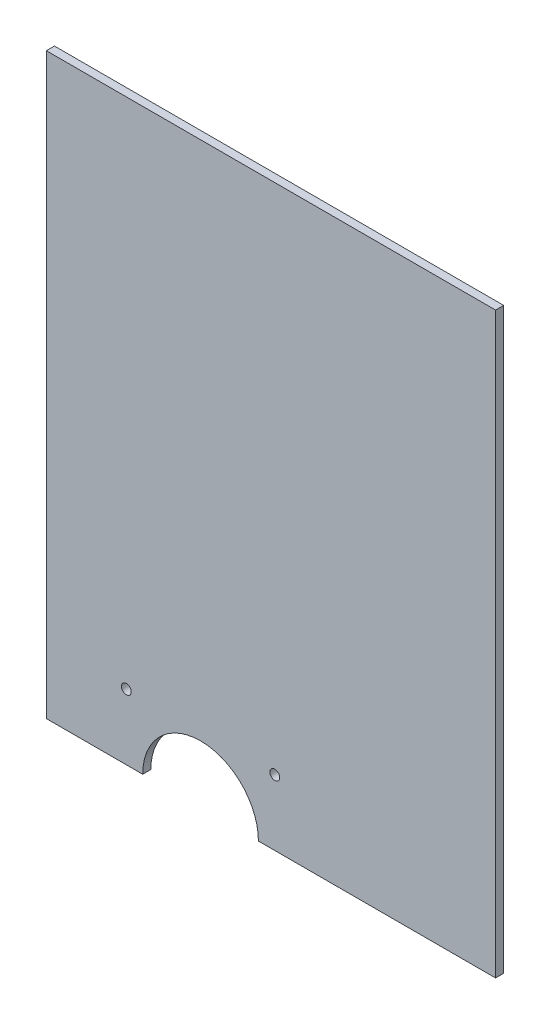
ISO-10303-21;
HEADER;
FILE_DESCRIPTION(('STEP AP214'),'2;1');
FILE_NAME('part.step','',(''),(''),'','','');
FILE_SCHEMA(('AUTOMOTIVE_DESIGN { 1 0 10303 214 1 1 1 1 }'));
ENDSEC;
DATA;
#1=APPLICATION_CONTEXT('core data for automotive mechanical design processes');
#2=APPLICATION_PROTOCOL_DEFINITION('international standard','automotive_design',2000,#1);
#3=PRODUCT_CONTEXT('',#1,'mechanical');
#4=PRODUCT('Part','Part','',(#3));
#5=PRODUCT_RELATED_PRODUCT_CATEGORY('part','',(#4));
#6=PRODUCT_DEFINITION_FORMATION('','',#4);
#7=PRODUCT_DEFINITION_CONTEXT('part definition',#1,'design');
#8=PRODUCT_DEFINITION('design','',#6,#7);
#9=PRODUCT_DEFINITION_SHAPE('','',#8);
#10=(LENGTH_UNIT() NAMED_UNIT(*) SI_UNIT(.MILLI.,.METRE.));
#11=(NAMED_UNIT(*) PLANE_ANGLE_UNIT() SI_UNIT($,.RADIAN.));
#12=(NAMED_UNIT(*) SI_UNIT($,.STERADIAN.) SOLID_ANGLE_UNIT());
#13=UNCERTAINTY_MEASURE_WITH_UNIT(LENGTH_MEASURE(1.E-05),#10,'distance_accuracy_value','');
#14=(GEOMETRIC_REPRESENTATION_CONTEXT(3) GLOBAL_UNCERTAINTY_ASSIGNED_CONTEXT((#13)) GLOBAL_UNIT_ASSIGNED_CONTEXT((#10,
#11,#12)) REPRESENTATION_CONTEXT('',''));
#15=CARTESIAN_POINT('',(0.,0.,0.));
#16=DIRECTION('',(0.,0.,1.));
#17=DIRECTION('',(1.,0.,0.));
#18=AXIS2_PLACEMENT_3D('',#15,#16,#17);
#19=CARTESIAN_POINT('',(-119.563037439145,-231.267653758542,4.2));
#20=DIRECTION('',(0.,1.,0.));
#21=DIRECTION('',(0.,0.,1.));
#22=AXIS2_PLACEMENT_3D('',#19,#20,#21);
#23=PLANE('',#22);
#24=DIRECTION('',(1.,0.,0.));
#25=VECTOR('',#24,1.);
#26=CARTESIAN_POINT('',(-119.563037439145,-231.267653758542,0.));
#27=LINE('',#26,#25);
#28=CARTESIAN_POINT('',(-119.563037439145,-231.267653758542,0.));
#29=VERTEX_POINT('',#28);
#30=CARTESIAN_POINT('',(-69.5630374391453,-231.267653758542,0.));
#31=VERTEX_POINT('',#30);
#32=EDGE_CURVE('E124',#29,#31,#27,.T.);
#33=ORIENTED_EDGE('',*,*,#32,.T.);
#34=DIRECTION('',(0.,0.,1.));
#35=VECTOR('',#34,1.);
#36=CARTESIAN_POINT('',(-69.5630374391453,-231.267653758542,0.));
#37=LINE('',#36,#35);
#38=CARTESIAN_POINT('',(-69.5630374391453,-231.267653758542,4.2));
#39=VERTEX_POINT('',#38);
#40=EDGE_CURVE('E55',#31,#39,#37,.T.);
#41=ORIENTED_EDGE('',*,*,#40,.T.);
#42=DIRECTION('',(1.,0.,0.));
#43=VECTOR('',#42,1.);
#44=CARTESIAN_POINT('',(-119.563037439145,-231.267653758542,4.2));
#45=LINE('',#44,#43);
#46=CARTESIAN_POINT('',(-119.563037439145,-231.267653758542,4.2));
#47=VERTEX_POINT('',#46);
#48=EDGE_CURVE('E91',#47,#39,#45,.T.);
#49=ORIENTED_EDGE('',*,*,#48,.F.);
#50=DIRECTION('',(0.,0.,-1.));
#51=VECTOR('',#50,1.);
#52=CARTESIAN_POINT('',(-119.563037439145,-231.267653758542,4.2));
#53=LINE('',#52,#51);
#54=EDGE_CURVE('E11',#47,#29,#53,.T.);
#55=ORIENTED_EDGE('',*,*,#54,.T.);
#56=EDGE_LOOP('',(#33,#41,#49,#55));
#57=FACE_BOUND('',#56,.T.);
#58=ADVANCED_FACE('F39',(#57),#23,.F.);
#59=CARTESIAN_POINT('',(-119.563037439145,68.7323462414579,4.2));
#60=DIRECTION('',(1.,0.,0.));
#61=DIRECTION('',(0.,1.,0.));
#62=AXIS2_PLACEMENT_3D('',#59,#60,#61);
#63=PLANE('',#62);
#64=DIRECTION('',(0.,-1.,0.));
#65=VECTOR('',#64,1.);
#66=CARTESIAN_POINT('',(-119.563037439145,68.7323462414579,0.));
#67=LINE('',#66,#65);
#68=CARTESIAN_POINT('',(-119.563037439145,68.7323462414579,0.));
#69=VERTEX_POINT('',#68);
#70=EDGE_CURVE('E125',#69,#29,#67,.T.);
#71=ORIENTED_EDGE('',*,*,#70,.T.);
#72=ORIENTED_EDGE('',*,*,#54,.F.);
#73=DIRECTION('',(0.,-1.,0.));
#74=VECTOR('',#73,1.);
#75=CARTESIAN_POINT('',(-119.563037439145,68.7323462414579,4.2));
#76=LINE('',#75,#74);
#77=CARTESIAN_POINT('',(-119.563037439145,68.7323462414579,4.2));
#78=VERTEX_POINT('',#77);
#79=EDGE_CURVE('E138',#78,#47,#76,.T.);
#80=ORIENTED_EDGE('',*,*,#79,.F.);
#81=DIRECTION('',(0.,0.,-1.));
#82=VECTOR('',#81,1.);
#83=CARTESIAN_POINT('',(-119.563037439145,68.7323462414579,4.2));
#84=LINE('',#83,#82);
#85=EDGE_CURVE('E139',#78,#69,#84,.T.);
#86=ORIENTED_EDGE('',*,*,#85,.T.);
#87=EDGE_LOOP('',(#71,#72,#80,#86));
#88=FACE_BOUND('',#87,.T.);
#89=ADVANCED_FACE('F41',(#88),#63,.F.);
#90=CARTESIAN_POINT('',(-9.56303743914533,-231.267653758542,4.2));
#91=VERTEX_POINT('',#90);
#92=CARTESIAN_POINT('',(113.436962560855,-231.267653758542,4.2));
#93=VERTEX_POINT('',#92);
#94=EDGE_CURVE('E116',#91,#93,#45,.T.);
#95=ORIENTED_EDGE('',*,*,#94,.F.);
#96=DIRECTION('',(0.,0.,1.));
#97=VECTOR('',#96,1.);
#98=CARTESIAN_POINT('',(-9.56303743914533,-231.267653758542,0.));
#99=LINE('',#98,#97);
#100=CARTESIAN_POINT('',(-9.56303743914533,-231.267653758542,0.));
#101=VERTEX_POINT('',#100);
#102=EDGE_CURVE('E102',#101,#91,#99,.T.);
#103=ORIENTED_EDGE('',*,*,#102,.F.);
#104=CARTESIAN_POINT('',(113.436962560855,-231.267653758542,0.));
#105=VERTEX_POINT('',#104);
#106=EDGE_CURVE('E114',#101,#105,#27,.T.);
#107=ORIENTED_EDGE('',*,*,#106,.T.);
#108=DIRECTION('',(0.,0.,-1.));
#109=VECTOR('',#108,1.);
#110=CARTESIAN_POINT('',(113.436962560855,-231.267653758542,4.2));
#111=LINE('',#110,#109);
#112=EDGE_CURVE('E48',#93,#105,#111,.T.);
#113=ORIENTED_EDGE('',*,*,#112,.F.);
#114=EDGE_LOOP('',(#95,#103,#107,#113));
#115=FACE_BOUND('',#114,.T.);
#116=ADVANCED_FACE('F112',(#115),#23,.F.);
#117=CARTESIAN_POINT('',(113.436962560855,68.7323462414579,4.2));
#118=DIRECTION('',(-1.,0.,0.));
#119=DIRECTION('',(0.,-1.,0.));
#120=AXIS2_PLACEMENT_3D('',#117,#118,#119);
#121=PLANE('',#120);
#122=DIRECTION('',(0.,1.,0.));
#123=VECTOR('',#122,1.);
#124=CARTESIAN_POINT('',(113.436962560855,68.7323462414579,0.));
#125=LINE('',#124,#123);
#126=CARTESIAN_POINT('',(113.436962560855,68.7323462414579,0.));
#127=VERTEX_POINT('',#126);
#128=EDGE_CURVE('E122',#105,#127,#125,.T.);
#129=ORIENTED_EDGE('',*,*,#128,.T.);
#130=DIRECTION('',(0.,0.,-1.));
#131=VECTOR('',#130,1.);
#132=CARTESIAN_POINT('',(113.436962560855,68.7323462414579,4.2));
#133=LINE('',#132,#131);
#134=CARTESIAN_POINT('',(113.436962560855,68.7323462414579,4.2));
#135=VERTEX_POINT('',#134);
#136=EDGE_CURVE('E142',#135,#127,#133,.T.);
#137=ORIENTED_EDGE('',*,*,#136,.F.);
#138=DIRECTION('',(0.,1.,0.));
#139=VECTOR('',#138,1.);
#140=CARTESIAN_POINT('',(113.436962560855,68.7323462414579,4.2));
#141=LINE('',#140,#139);
#142=EDGE_CURVE('E149',#93,#135,#141,.T.);
#143=ORIENTED_EDGE('',*,*,#142,.F.);
#144=ORIENTED_EDGE('',*,*,#112,.T.);
#145=EDGE_LOOP('',(#129,#137,#143,#144));
#146=FACE_BOUND('',#145,.T.);
#147=ADVANCED_FACE('F147',(#146),#121,.F.);
#148=CARTESIAN_POINT('',(-119.563037439145,68.7323462414579,4.2));
#149=DIRECTION('',(0.,-1.,0.));
#150=DIRECTION('',(0.,0.,-1.));
#151=AXIS2_PLACEMENT_3D('',#148,#149,#150);
#152=PLANE('',#151);
#153=DIRECTION('',(-1.,0.,0.));
#154=VECTOR('',#153,1.);
#155=CARTESIAN_POINT('',(-119.563037439145,68.7323462414579,0.));
#156=LINE('',#155,#154);
#157=EDGE_CURVE('E85',#127,#69,#156,.T.);
#158=ORIENTED_EDGE('',*,*,#157,.T.);
#159=ORIENTED_EDGE('',*,*,#85,.F.);
#160=DIRECTION('',(-1.,0.,0.));
#161=VECTOR('',#160,1.);
#162=CARTESIAN_POINT('',(-119.563037439145,68.7323462414579,4.2));
#163=LINE('',#162,#161);
#164=EDGE_CURVE('E64',#135,#78,#163,.T.);
#165=ORIENTED_EDGE('',*,*,#164,.F.);
#166=ORIENTED_EDGE('',*,*,#136,.T.);
#167=EDGE_LOOP('',(#158,#159,#165,#166));
#168=FACE_BOUND('',#167,.T.);
#169=ADVANCED_FACE('F189',(#168),#152,.F.);
#170=CARTESIAN_POINT('',(0.,0.,4.2));
#171=DIRECTION('',(0.,0.,1.));
#172=DIRECTION('',(1.,0.,0.));
#173=AXIS2_PLACEMENT_3D('',#170,#171,#172);
#174=PLANE('',#173);
#175=CARTESIAN_POINT('',(-78.0630374391453,-197.267653758542,4.2));
#176=DIRECTION('',(0.,0.,1.));
#177=DIRECTION('',(1.,0.,0.));
#178=AXIS2_PLACEMENT_3D('',#175,#176,#177);
#179=CIRCLE('',#178,2.54999999999999);
#180=CARTESIAN_POINT('',(-75.5130374391453,-197.267653758542,4.2));
#181=VERTEX_POINT('',#180);
#182=EDGE_CURVE('E169',#181,#181,#179,.T.);
#183=ORIENTED_EDGE('',*,*,#182,.F.);
#184=EDGE_LOOP('',(#183));
#185=FACE_BOUND('',#184,.T.);
#186=CARTESIAN_POINT('',(-1.06303743914533,-197.267653758542,4.2));
#187=DIRECTION('',(0.,0.,1.));
#188=DIRECTION('',(1.,0.,0.));
#189=AXIS2_PLACEMENT_3D('',#186,#187,#188);
#190=CIRCLE('',#189,2.54999999999999);
#191=CARTESIAN_POINT('',(1.48696256085466,-197.267653758542,4.2));
#192=VERTEX_POINT('',#191);
#193=EDGE_CURVE('E118',#192,#192,#190,.T.);
#194=ORIENTED_EDGE('',*,*,#193,.F.);
#195=EDGE_LOOP('',(#194));
#196=FACE_BOUND('',#195,.T.);
#197=CARTESIAN_POINT('',(-39.5630374391453,-231.267653758542,4.2));
#198=DIRECTION('',(0.,0.,1.));
#199=DIRECTION('',(-1.,0.,0.));
#200=AXIS2_PLACEMENT_3D('',#197,#198,#199);
#201=CIRCLE('',#200,30.);
#202=EDGE_CURVE('E108',#91,#39,#201,.T.);
#203=ORIENTED_EDGE('',*,*,#202,.F.);
#204=ORIENTED_EDGE('',*,*,#94,.T.);
#205=ORIENTED_EDGE('',*,*,#142,.T.);
#206=ORIENTED_EDGE('',*,*,#164,.T.);
#207=ORIENTED_EDGE('',*,*,#79,.T.);
#208=ORIENTED_EDGE('',*,*,#48,.T.);
#209=EDGE_LOOP('',(#203,#204,#205,#206,#207,#208));
#210=FACE_BOUND('',#209,.T.);
#211=ADVANCED_FACE('F186',(#185,#196,#210),#174,.T.);
#212=CARTESIAN_POINT('',(0.,0.,0.));
#213=DIRECTION('',(0.,0.,1.));
#214=DIRECTION('',(1.,0.,0.));
#215=AXIS2_PLACEMENT_3D('',#212,#213,#214);
#216=PLANE('',#215);
#217=CARTESIAN_POINT('',(-78.0630374391453,-197.267653758542,0.));
#218=DIRECTION('',(0.,0.,1.));
#219=DIRECTION('',(1.,0.,0.));
#220=AXIS2_PLACEMENT_3D('',#217,#218,#219);
#221=CIRCLE('',#220,2.54999999999999);
#222=CARTESIAN_POINT('',(-75.5130374391453,-197.267653758542,0.));
#223=VERTEX_POINT('',#222);
#224=EDGE_CURVE('E130',#223,#223,#221,.T.);
#225=ORIENTED_EDGE('',*,*,#224,.T.);
#226=EDGE_LOOP('',(#225));
#227=FACE_BOUND('',#226,.T.);
#228=CARTESIAN_POINT('',(-1.06303743914533,-197.267653758542,0.));
#229=DIRECTION('',(0.,0.,1.));
#230=DIRECTION('',(1.,0.,0.));
#231=AXIS2_PLACEMENT_3D('',#228,#229,#230);
#232=CIRCLE('',#231,2.54999999999999);
#233=CARTESIAN_POINT('',(1.48696256085466,-197.267653758542,0.));
#234=VERTEX_POINT('',#233);
#235=EDGE_CURVE('E165',#234,#234,#232,.T.);
#236=ORIENTED_EDGE('',*,*,#235,.T.);
#237=EDGE_LOOP('',(#236));
#238=FACE_BOUND('',#237,.T.);
#239=ORIENTED_EDGE('',*,*,#106,.F.);
#240=CARTESIAN_POINT('',(-39.5630374391453,-231.267653758542,0.));
#241=DIRECTION('',(0.,0.,1.));
#242=DIRECTION('',(-1.,0.,0.));
#243=AXIS2_PLACEMENT_3D('',#240,#241,#242);
#244=CIRCLE('',#243,30.);
#245=EDGE_CURVE('E99',#101,#31,#244,.T.);
#246=ORIENTED_EDGE('',*,*,#245,.T.);
#247=ORIENTED_EDGE('',*,*,#32,.F.);
#248=ORIENTED_EDGE('',*,*,#70,.F.);
#249=ORIENTED_EDGE('',*,*,#157,.F.);
#250=ORIENTED_EDGE('',*,*,#128,.F.);
#251=EDGE_LOOP('',(#239,#246,#247,#248,#249,#250));
#252=FACE_BOUND('',#251,.T.);
#253=ADVANCED_FACE('F121',(#227,#238,#252),#216,.F.);
#254=CARTESIAN_POINT('',(-39.5630374391453,-231.267653758542,0.));
#255=DIRECTION('',(0.,0.,1.));
#256=DIRECTION('',(1.,0.,0.));
#257=AXIS2_PLACEMENT_3D('',#254,#255,#256);
#258=CYLINDRICAL_SURFACE('',#257,30.);
#259=ORIENTED_EDGE('',*,*,#202,.T.);
#260=ORIENTED_EDGE('',*,*,#40,.F.);
#261=ORIENTED_EDGE('',*,*,#245,.F.);
#262=ORIENTED_EDGE('',*,*,#102,.T.);
#263=EDGE_LOOP('',(#259,#260,#261,#262));
#264=FACE_BOUND('',#263,.T.);
#265=ADVANCED_FACE('F101',(#264),#258,.F.);
#266=CARTESIAN_POINT('',(-1.06303743914533,-197.267653758542,0.));
#267=DIRECTION('',(0.,0.,1.));
#268=DIRECTION('',(1.,0.,0.));
#269=AXIS2_PLACEMENT_3D('',#266,#267,#268);
#270=CYLINDRICAL_SURFACE('',#269,2.54999999999999);
#271=ORIENTED_EDGE('',*,*,#235,.F.);
#272=EDGE_LOOP('',(#271));
#273=FACE_BOUND('',#272,.T.);
#274=ORIENTED_EDGE('',*,*,#193,.T.);
#275=EDGE_LOOP('',(#274));
#276=FACE_BOUND('',#275,.T.);
#277=ADVANCED_FACE('F182',(#273,#276),#270,.F.);
#278=CARTESIAN_POINT('',(-78.0630374391453,-197.267653758542,0.));
#279=DIRECTION('',(0.,0.,1.));
#280=DIRECTION('',(1.,0.,0.));
#281=AXIS2_PLACEMENT_3D('',#278,#279,#280);
#282=CYLINDRICAL_SURFACE('',#281,2.54999999999999);
#283=ORIENTED_EDGE('',*,*,#224,.F.);
#284=EDGE_LOOP('',(#283));
#285=FACE_BOUND('',#284,.T.);
#286=ORIENTED_EDGE('',*,*,#182,.T.);
#287=EDGE_LOOP('',(#286));
#288=FACE_BOUND('',#287,.T.);
#289=ADVANCED_FACE('F179',(#285,#288),#282,.F.);
#290=CLOSED_SHELL('',(#58,#89,#116,#147,#169,#211,#253,#265,#277,#289));
#291=MANIFOLD_SOLID_BREP('B2',#290);
#292=ADVANCED_BREP_SHAPE_REPRESENTATION('',(#18,#291),#14);
#293=SHAPE_DEFINITION_REPRESENTATION(#9,#292);
ENDSEC;
END-ISO-10303-21;
